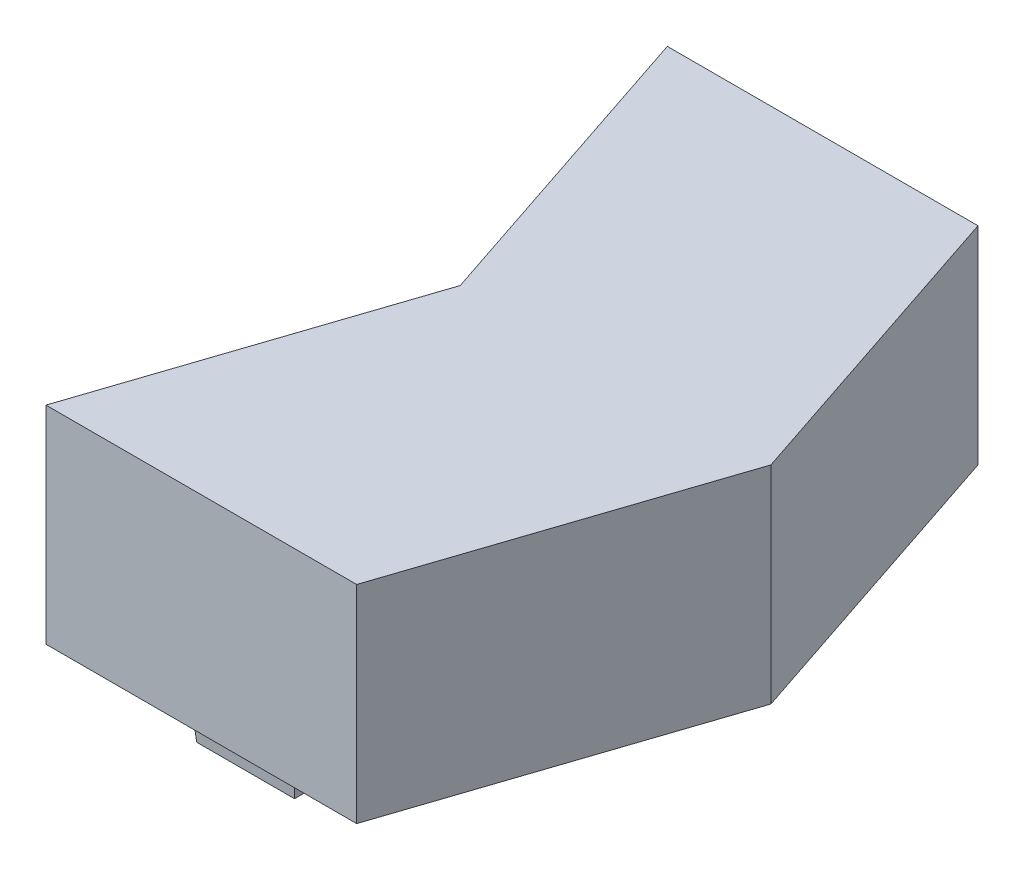
ISO-10303-21;
HEADER;
FILE_DESCRIPTION(('STEP AP214'),'2;1');
FILE_NAME('part.step','',(''),(''),'','','');
FILE_SCHEMA(('AUTOMOTIVE_DESIGN { 1 0 10303 214 1 1 1 1 }'));
ENDSEC;
DATA;
#1=APPLICATION_CONTEXT('core data for automotive mechanical design processes');
#2=APPLICATION_PROTOCOL_DEFINITION('international standard','automotive_design',2000,#1);
#3=PRODUCT_CONTEXT('',#1,'mechanical');
#4=PRODUCT('Part','Part','',(#3));
#5=PRODUCT_RELATED_PRODUCT_CATEGORY('part','',(#4));
#6=PRODUCT_DEFINITION_FORMATION('','',#4);
#7=PRODUCT_DEFINITION_CONTEXT('part definition',#1,'design');
#8=PRODUCT_DEFINITION('design','',#6,#7);
#9=PRODUCT_DEFINITION_SHAPE('','',#8);
#10=(LENGTH_UNIT() NAMED_UNIT(*) SI_UNIT(.MILLI.,.METRE.));
#11=(NAMED_UNIT(*) PLANE_ANGLE_UNIT() SI_UNIT($,.RADIAN.));
#12=(NAMED_UNIT(*) SI_UNIT($,.STERADIAN.) SOLID_ANGLE_UNIT());
#13=UNCERTAINTY_MEASURE_WITH_UNIT(LENGTH_MEASURE(1.E-05),#10,'distance_accuracy_value','');
#14=(GEOMETRIC_REPRESENTATION_CONTEXT(3) GLOBAL_UNCERTAINTY_ASSIGNED_CONTEXT((#13)) GLOBAL_UNIT_ASSIGNED_CONTEXT((#10,
#11,#12)) REPRESENTATION_CONTEXT('',''));
#15=CARTESIAN_POINT('',(0.,0.,0.));
#16=DIRECTION('',(0.,0.,1.));
#17=DIRECTION('',(1.,0.,0.));
#18=AXIS2_PLACEMENT_3D('',#15,#16,#17);
#19=CARTESIAN_POINT('',(0.,0.,0.));
#20=DIRECTION('',(0.,1.,0.));
#21=DIRECTION('',(0.,0.,1.));
#22=AXIS2_PLACEMENT_3D('',#19,#20,#21);
#23=PLANE('',#22);
#24=DIRECTION('',(1.,0.,0.));
#25=VECTOR('',#24,1.);
#26=CARTESIAN_POINT('',(13.97,0.,-1.27000000000001));
#27=LINE('',#26,#25);
#28=CARTESIAN_POINT('',(7.62,0.,-1.27));
#29=VERTEX_POINT('',#28);
#30=CARTESIAN_POINT('',(13.97,0.,-1.27000000000001));
#31=VERTEX_POINT('',#30);
#32=EDGE_CURVE('E173',#29,#31,#27,.T.);
#33=ORIENTED_EDGE('',*,*,#32,.T.);
#34=DIRECTION('',(0.,0.,-1.));
#35=VECTOR('',#34,1.);
#36=CARTESIAN_POINT('',(13.97,0.,-1.27000000000001));
#37=LINE('',#36,#35);
#38=CARTESIAN_POINT('',(13.97,0.,-3.81000000000001));
#39=VERTEX_POINT('',#38);
#40=EDGE_CURVE('E184',#31,#39,#37,.T.);
#41=ORIENTED_EDGE('',*,*,#40,.T.);
#42=DIRECTION('',(-1.,0.,0.));
#43=VECTOR('',#42,1.);
#44=CARTESIAN_POINT('',(13.97,0.,-3.81000000000001));
#45=LINE('',#44,#43);
#46=CARTESIAN_POINT('',(7.62,0.,-3.81000000000001));
#47=VERTEX_POINT('',#46);
#48=EDGE_CURVE('E196',#39,#47,#45,.T.);
#49=ORIENTED_EDGE('',*,*,#48,.T.);
#50=DIRECTION('',(0.,0.,1.));
#51=VECTOR('',#50,1.);
#52=CARTESIAN_POINT('',(7.62,0.,-1.27));
#53=LINE('',#52,#51);
#54=EDGE_CURVE('E59',#47,#29,#53,.T.);
#55=ORIENTED_EDGE('',*,*,#54,.T.);
#56=EDGE_LOOP('',(#33,#41,#49,#55));
#57=FACE_BOUND('',#56,.T.);
#58=DIRECTION('',(-0.316227766016838,0.,0.948683298050514));
#59=VECTOR('',#58,1.);
#60=CARTESIAN_POINT('',(6.35,0.,-19.05));
#61=LINE('',#60,#59);
#62=CARTESIAN_POINT('',(6.35,0.,-19.05));
#63=VERTEX_POINT('',#62);
#64=CARTESIAN_POINT('',(0.,0.,0.));
#65=VERTEX_POINT('',#64);
#66=EDGE_CURVE('E302',#63,#65,#61,.T.);
#67=ORIENTED_EDGE('',*,*,#66,.F.);
#68=DIRECTION('',(0.316227766016838,0.,0.948683298050514));
#69=VECTOR('',#68,1.);
#70=CARTESIAN_POINT('',(0.,0.,-38.1));
#71=LINE('',#70,#69);
#72=CARTESIAN_POINT('',(0.,0.,-38.1));
#73=VERTEX_POINT('',#72);
#74=EDGE_CURVE('E311',#73,#63,#71,.T.);
#75=ORIENTED_EDGE('',*,*,#74,.F.);
#76=DIRECTION('',(-1.,0.,0.));
#77=VECTOR('',#76,1.);
#78=CARTESIAN_POINT('',(19.05,0.,-38.1));
#79=LINE('',#78,#77);
#80=CARTESIAN_POINT('',(19.05,0.,-38.1));
#81=VERTEX_POINT('',#80);
#82=EDGE_CURVE('E339',#81,#73,#79,.T.);
#83=ORIENTED_EDGE('',*,*,#82,.F.);
#84=DIRECTION('',(-0.316227766016838,0.,-0.948683298050514));
#85=VECTOR('',#84,1.);
#86=CARTESIAN_POINT('',(25.4,0.,-19.05));
#87=LINE('',#86,#85);
#88=CARTESIAN_POINT('',(25.4,0.,-19.05));
#89=VERTEX_POINT('',#88);
#90=EDGE_CURVE('E336',#89,#81,#87,.T.);
#91=ORIENTED_EDGE('',*,*,#90,.F.);
#92=DIRECTION('',(0.316227766016838,0.,-0.948683298050514));
#93=VECTOR('',#92,1.);
#94=CARTESIAN_POINT('',(19.05,0.,0.));
#95=LINE('',#94,#93);
#96=CARTESIAN_POINT('',(19.05,0.,0.));
#97=VERTEX_POINT('',#96);
#98=EDGE_CURVE('E333',#97,#89,#95,.T.);
#99=ORIENTED_EDGE('',*,*,#98,.F.);
#100=DIRECTION('',(1.,0.,0.));
#101=VECTOR('',#100,1.);
#102=CARTESIAN_POINT('',(0.,0.,0.));
#103=LINE('',#102,#101);
#104=EDGE_CURVE('E330',#65,#97,#103,.T.);
#105=ORIENTED_EDGE('',*,*,#104,.F.);
#106=EDGE_LOOP('',(#67,#75,#83,#91,#99,#105));
#107=FACE_BOUND('',#106,.T.);
#108=CARTESIAN_POINT('',(15.24,0.,-19.05));
#109=DIRECTION('',(0.,-1.,0.));
#110=DIRECTION('',(0.,0.,-1.));
#111=AXIS2_PLACEMENT_3D('',#108,#109,#110);
#112=CIRCLE('',#111,5.635000033);
#113=CARTESIAN_POINT('',(16.51,0.,-24.5400205256365));
#114=VERTEX_POINT('',#113);
#115=CARTESIAN_POINT('',(13.97,0.,-24.5400205256365));
#116=VERTEX_POINT('',#115);
#117=EDGE_CURVE('E288',#114,#116,#112,.T.);
#118=ORIENTED_EDGE('',*,*,#117,.F.);
#119=DIRECTION('',(0.,0.,1.));
#120=VECTOR('',#119,1.);
#121=CARTESIAN_POINT('',(16.51,0.,-24.5400205256365));
#122=LINE('',#121,#120);
#123=CARTESIAN_POINT('',(16.51,0.,-28.3500205256365));
#124=VERTEX_POINT('',#123);
#125=EDGE_CURVE('E238',#124,#114,#122,.T.);
#126=ORIENTED_EDGE('',*,*,#125,.F.);
#127=DIRECTION('',(1.,0.,0.));
#128=VECTOR('',#127,1.);
#129=CARTESIAN_POINT('',(16.51,0.,-28.3500205256365));
#130=LINE('',#129,#128);
#131=CARTESIAN_POINT('',(13.97,0.,-28.3500205256365));
#132=VERTEX_POINT('',#131);
#133=EDGE_CURVE('E267',#132,#124,#130,.T.);
#134=ORIENTED_EDGE('',*,*,#133,.F.);
#135=DIRECTION('',(0.,0.,-1.));
#136=VECTOR('',#135,1.);
#137=CARTESIAN_POINT('',(13.97,0.,-24.5400205256365));
#138=LINE('',#137,#136);
#139=EDGE_CURVE('E278',#116,#132,#138,.T.);
#140=ORIENTED_EDGE('',*,*,#139,.F.);
#141=EDGE_LOOP('',(#118,#126,#134,#140));
#142=FACE_BOUND('',#141,.T.);
#143=DIRECTION('',(0.,0.,1.));
#144=VECTOR('',#143,1.);
#145=CARTESIAN_POINT('',(13.97,0.,-36.83));
#146=LINE('',#145,#144);
#147=CARTESIAN_POINT('',(13.97,0.,-36.83));
#148=VERTEX_POINT('',#147);
#149=CARTESIAN_POINT('',(13.97,0.,-34.29));
#150=VERTEX_POINT('',#149);
#151=EDGE_CURVE('E180',#148,#150,#146,.T.);
#152=ORIENTED_EDGE('',*,*,#151,.F.);
#153=DIRECTION('',(1.,0.,0.));
#154=VECTOR('',#153,1.);
#155=CARTESIAN_POINT('',(13.97,0.,-36.83));
#156=LINE('',#155,#154);
#157=CARTESIAN_POINT('',(7.62,0.,-36.83));
#158=VERTEX_POINT('',#157);
#159=EDGE_CURVE('E230',#158,#148,#156,.T.);
#160=ORIENTED_EDGE('',*,*,#159,.F.);
#161=DIRECTION('',(0.,0.,-1.));
#162=VECTOR('',#161,1.);
#163=CARTESIAN_POINT('',(7.62,0.,-36.83));
#164=LINE('',#163,#162);
#165=CARTESIAN_POINT('',(7.62,0.,-34.29));
#166=VERTEX_POINT('',#165);
#167=EDGE_CURVE('E226',#166,#158,#164,.T.);
#168=ORIENTED_EDGE('',*,*,#167,.F.);
#169=DIRECTION('',(-1.,0.,0.));
#170=VECTOR('',#169,1.);
#171=CARTESIAN_POINT('',(13.97,0.,-34.29));
#172=LINE('',#171,#170);
#173=EDGE_CURVE('E67',#150,#166,#172,.T.);
#174=ORIENTED_EDGE('',*,*,#173,.F.);
#175=EDGE_LOOP('',(#152,#160,#168,#174));
#176=FACE_BOUND('',#175,.T.);
#177=ADVANCED_FACE('F43',(#57,#107,#142,#176),#23,.F.);
#178=CARTESIAN_POINT('',(6.35,12.7,-19.05));
#179=DIRECTION('',(0.948683298050514,0.,0.316227766016838));
#180=DIRECTION('',(0.316227766016838,0.,-0.948683298050514));
#181=AXIS2_PLACEMENT_3D('',#178,#179,#180);
#182=PLANE('',#181);
#183=ORIENTED_EDGE('',*,*,#66,.T.);
#184=DIRECTION('',(0.,-1.,0.));
#185=VECTOR('',#184,1.);
#186=CARTESIAN_POINT('',(0.,12.7,0.));
#187=LINE('',#186,#185);
#188=CARTESIAN_POINT('',(0.,12.7,0.));
#189=VERTEX_POINT('',#188);
#190=EDGE_CURVE('E11',#189,#65,#187,.T.);
#191=ORIENTED_EDGE('',*,*,#190,.F.);
#192=DIRECTION('',(-0.316227766016838,0.,0.948683298050514));
#193=VECTOR('',#192,1.);
#194=CARTESIAN_POINT('',(6.35,12.7,-19.05));
#195=LINE('',#194,#193);
#196=CARTESIAN_POINT('',(6.35,12.7,-19.05));
#197=VERTEX_POINT('',#196);
#198=EDGE_CURVE('E306',#197,#189,#195,.T.);
#199=ORIENTED_EDGE('',*,*,#198,.F.);
#200=DIRECTION('',(0.,-1.,0.));
#201=VECTOR('',#200,1.);
#202=CARTESIAN_POINT('',(6.35,12.7,-19.05));
#203=LINE('',#202,#201);
#204=EDGE_CURVE('E326',#197,#63,#203,.T.);
#205=ORIENTED_EDGE('',*,*,#204,.T.);
#206=EDGE_LOOP('',(#183,#191,#199,#205));
#207=FACE_BOUND('',#206,.T.);
#208=ADVANCED_FACE('F45',(#207),#182,.F.);
#209=CARTESIAN_POINT('',(0.,12.7,0.));
#210=DIRECTION('',(0.,0.,-1.));
#211=DIRECTION('',(-1.,0.,0.));
#212=AXIS2_PLACEMENT_3D('',#209,#210,#211);
#213=PLANE('',#212);
#214=ORIENTED_EDGE('',*,*,#104,.T.);
#215=DIRECTION('',(0.,-1.,0.));
#216=VECTOR('',#215,1.);
#217=CARTESIAN_POINT('',(19.05,12.7,0.));
#218=LINE('',#217,#216);
#219=CARTESIAN_POINT('',(19.05,12.7,0.));
#220=VERTEX_POINT('',#219);
#221=EDGE_CURVE('E52',#220,#97,#218,.T.);
#222=ORIENTED_EDGE('',*,*,#221,.F.);
#223=DIRECTION('',(1.,0.,0.));
#224=VECTOR('',#223,1.);
#225=CARTESIAN_POINT('',(0.,12.7,0.));
#226=LINE('',#225,#224);
#227=EDGE_CURVE('E310',#189,#220,#226,.T.);
#228=ORIENTED_EDGE('',*,*,#227,.F.);
#229=ORIENTED_EDGE('',*,*,#190,.T.);
#230=EDGE_LOOP('',(#214,#222,#228,#229));
#231=FACE_BOUND('',#230,.T.);
#232=ADVANCED_FACE('F386',(#231),#213,.F.);
#233=CARTESIAN_POINT('',(19.05,12.7,0.));
#234=DIRECTION('',(-0.948683298050514,0.,-0.316227766016838));
#235=DIRECTION('',(-0.316227766016838,0.,0.948683298050514));
#236=AXIS2_PLACEMENT_3D('',#233,#234,#235);
#237=PLANE('',#236);
#238=ORIENTED_EDGE('',*,*,#98,.T.);
#239=DIRECTION('',(0.,-1.,0.));
#240=VECTOR('',#239,1.);
#241=CARTESIAN_POINT('',(25.4,12.7,-19.05));
#242=LINE('',#241,#240);
#243=CARTESIAN_POINT('',(25.4,12.7,-19.05));
#244=VERTEX_POINT('',#243);
#245=EDGE_CURVE('E355',#244,#89,#242,.T.);
#246=ORIENTED_EDGE('',*,*,#245,.F.);
#247=DIRECTION('',(0.316227766016838,0.,-0.948683298050514));
#248=VECTOR('',#247,1.);
#249=CARTESIAN_POINT('',(19.05,12.7,0.));
#250=LINE('',#249,#248);
#251=EDGE_CURVE('E314',#220,#244,#250,.T.);
#252=ORIENTED_EDGE('',*,*,#251,.F.);
#253=ORIENTED_EDGE('',*,*,#221,.T.);
#254=EDGE_LOOP('',(#238,#246,#252,#253));
#255=FACE_BOUND('',#254,.T.);
#256=ADVANCED_FACE('F364',(#255),#237,.F.);
#257=CARTESIAN_POINT('',(25.4,12.7,-19.05));
#258=DIRECTION('',(-0.948683298050514,0.,0.316227766016838));
#259=DIRECTION('',(0.316227766016838,0.,0.948683298050514));
#260=AXIS2_PLACEMENT_3D('',#257,#258,#259);
#261=PLANE('',#260);
#262=ORIENTED_EDGE('',*,*,#90,.T.);
#263=DIRECTION('',(0.,-1.,0.));
#264=VECTOR('',#263,1.);
#265=CARTESIAN_POINT('',(19.05,12.7,-38.1));
#266=LINE('',#265,#264);
#267=CARTESIAN_POINT('',(19.05,12.7,-38.1));
#268=VERTEX_POINT('',#267);
#269=EDGE_CURVE('E351',#268,#81,#266,.T.);
#270=ORIENTED_EDGE('',*,*,#269,.F.);
#271=DIRECTION('',(-0.316227766016838,0.,-0.948683298050514));
#272=VECTOR('',#271,1.);
#273=CARTESIAN_POINT('',(25.4,12.7,-19.05));
#274=LINE('',#273,#272);
#275=EDGE_CURVE('E317',#244,#268,#274,.T.);
#276=ORIENTED_EDGE('',*,*,#275,.F.);
#277=ORIENTED_EDGE('',*,*,#245,.T.);
#278=EDGE_LOOP('',(#262,#270,#276,#277));
#279=FACE_BOUND('',#278,.T.);
#280=ADVANCED_FACE('F374',(#279),#261,.F.);
#281=CARTESIAN_POINT('',(19.05,12.7,-38.1));
#282=DIRECTION('',(0.,0.,1.));
#283=DIRECTION('',(1.,0.,0.));
#284=AXIS2_PLACEMENT_3D('',#281,#282,#283);
#285=PLANE('',#284);
#286=ORIENTED_EDGE('',*,*,#82,.T.);
#287=DIRECTION('',(0.,-1.,0.));
#288=VECTOR('',#287,1.);
#289=CARTESIAN_POINT('',(0.,12.7,-38.1));
#290=LINE('',#289,#288);
#291=CARTESIAN_POINT('',(0.,12.7,-38.1));
#292=VERTEX_POINT('',#291);
#293=EDGE_CURVE('E347',#292,#73,#290,.T.);
#294=ORIENTED_EDGE('',*,*,#293,.F.);
#295=DIRECTION('',(-1.,0.,0.));
#296=VECTOR('',#295,1.);
#297=CARTESIAN_POINT('',(19.05,12.7,-38.1));
#298=LINE('',#297,#296);
#299=EDGE_CURVE('E320',#268,#292,#298,.T.);
#300=ORIENTED_EDGE('',*,*,#299,.F.);
#301=ORIENTED_EDGE('',*,*,#269,.T.);
#302=EDGE_LOOP('',(#286,#294,#300,#301));
#303=FACE_BOUND('',#302,.T.);
#304=ADVANCED_FACE('F378',(#303),#285,.F.);
#305=CARTESIAN_POINT('',(0.,12.7,-38.1));
#306=DIRECTION('',(0.948683298050514,0.,-0.316227766016838));
#307=DIRECTION('',(-0.316227766016838,0.,-0.948683298050514));
#308=AXIS2_PLACEMENT_3D('',#305,#306,#307);
#309=PLANE('',#308);
#310=ORIENTED_EDGE('',*,*,#74,.T.);
#311=ORIENTED_EDGE('',*,*,#204,.F.);
#312=DIRECTION('',(0.316227766016838,0.,0.948683298050514));
#313=VECTOR('',#312,1.);
#314=CARTESIAN_POINT('',(0.,12.7,-38.1));
#315=LINE('',#314,#313);
#316=EDGE_CURVE('E323',#292,#197,#315,.T.);
#317=ORIENTED_EDGE('',*,*,#316,.F.);
#318=ORIENTED_EDGE('',*,*,#293,.T.);
#319=EDGE_LOOP('',(#310,#311,#317,#318));
#320=FACE_BOUND('',#319,.T.);
#321=ADVANCED_FACE('F389',(#320),#309,.F.);
#322=CARTESIAN_POINT('',(0.,12.7,0.));
#323=DIRECTION('',(0.,1.,0.));
#324=DIRECTION('',(0.,0.,1.));
#325=AXIS2_PLACEMENT_3D('',#322,#323,#324);
#326=PLANE('',#325);
#327=ORIENTED_EDGE('',*,*,#198,.T.);
#328=ORIENTED_EDGE('',*,*,#227,.T.);
#329=ORIENTED_EDGE('',*,*,#251,.T.);
#330=ORIENTED_EDGE('',*,*,#275,.T.);
#331=ORIENTED_EDGE('',*,*,#299,.T.);
#332=ORIENTED_EDGE('',*,*,#316,.T.);
#333=EDGE_LOOP('',(#327,#328,#329,#330,#331,#332));
#334=FACE_BOUND('',#333,.T.);
#335=ADVANCED_FACE('F382',(#334),#326,.T.);
#336=CARTESIAN_POINT('',(15.24,9.557999934,-19.05));
#337=DIRECTION('',(0.,-1.,0.));
#338=DIRECTION('',(0.,0.,-1.));
#339=AXIS2_PLACEMENT_3D('',#336,#337,#338);
#340=CYLINDRICAL_SURFACE('',#339,5.635000033);
#341=ORIENTED_EDGE('',*,*,#117,.T.);
#342=DIRECTION('',(0.,-1.,0.));
#343=VECTOR('',#342,1.);
#344=CARTESIAN_POINT('',(13.97,9.557999934,-24.5400205256365));
#345=LINE('',#344,#343);
#346=CARTESIAN_POINT('',(13.97,9.557999934,-24.5400205256365));
#347=VERTEX_POINT('',#346);
#348=EDGE_CURVE('E292',#347,#116,#345,.T.);
#349=ORIENTED_EDGE('',*,*,#348,.F.);
#350=CARTESIAN_POINT('',(15.24,9.557999934,-19.05));
#351=DIRECTION('',(0.,-1.,0.));
#352=DIRECTION('',(0.,0.,-1.));
#353=AXIS2_PLACEMENT_3D('',#350,#351,#352);
#354=CIRCLE('',#353,5.635000033);
#355=CARTESIAN_POINT('',(16.51,9.557999934,-24.5400205256365));
#356=VERTEX_POINT('',#355);
#357=EDGE_CURVE('E298',#356,#347,#354,.T.);
#358=ORIENTED_EDGE('',*,*,#357,.F.);
#359=DIRECTION('',(0.,-1.,0.));
#360=VECTOR('',#359,1.);
#361=CARTESIAN_POINT('',(16.51,9.557999934,-24.5400205256365));
#362=LINE('',#361,#360);
#363=EDGE_CURVE('E275',#356,#114,#362,.T.);
#364=ORIENTED_EDGE('',*,*,#363,.T.);
#365=EDGE_LOOP('',(#341,#349,#358,#364));
#366=FACE_BOUND('',#365,.T.);
#367=ADVANCED_FACE('F396',(#366),#340,.F.);
#368=CARTESIAN_POINT('',(15.24,9.557999934,-19.05));
#369=DIRECTION('',(0.,-1.,0.));
#370=DIRECTION('',(0.,0.,-1.));
#371=AXIS2_PLACEMENT_3D('',#368,#369,#370);
#372=PLANE('',#371);
#373=ORIENTED_EDGE('',*,*,#357,.T.);
#374=DIRECTION('',(0.,0.,-1.));
#375=VECTOR('',#374,1.);
#376=CARTESIAN_POINT('',(13.97,9.557999934,-24.5400205256365));
#377=LINE('',#376,#375);
#378=CARTESIAN_POINT('',(13.97,9.557999934,-28.3500205256365));
#379=VERTEX_POINT('',#378);
#380=EDGE_CURVE('E266',#347,#379,#377,.T.);
#381=ORIENTED_EDGE('',*,*,#380,.T.);
#382=DIRECTION('',(1.,0.,0.));
#383=VECTOR('',#382,1.);
#384=CARTESIAN_POINT('',(16.51,9.557999934,-28.3500205256365));
#385=LINE('',#384,#383);
#386=CARTESIAN_POINT('',(16.51,9.557999934,-28.3500205256365));
#387=VERTEX_POINT('',#386);
#388=EDGE_CURVE('E271',#379,#387,#385,.T.);
#389=ORIENTED_EDGE('',*,*,#388,.T.);
#390=DIRECTION('',(0.,0.,1.));
#391=VECTOR('',#390,1.);
#392=CARTESIAN_POINT('',(16.51,9.557999934,-24.5400205256365));
#393=LINE('',#392,#391);
#394=EDGE_CURVE('E263',#387,#356,#393,.T.);
#395=ORIENTED_EDGE('',*,*,#394,.T.);
#396=EDGE_LOOP('',(#373,#381,#389,#395));
#397=FACE_BOUND('',#396,.T.);
#398=ADVANCED_FACE('F407',(#397),#372,.T.);
#399=CARTESIAN_POINT('',(16.51,9.557999934,-24.5400205256365));
#400=DIRECTION('',(1.,0.,0.));
#401=DIRECTION('',(0.,0.,-1.));
#402=AXIS2_PLACEMENT_3D('',#399,#400,#401);
#403=PLANE('',#402);
#404=ORIENTED_EDGE('',*,*,#125,.T.);
#405=ORIENTED_EDGE('',*,*,#363,.F.);
#406=ORIENTED_EDGE('',*,*,#394,.F.);
#407=DIRECTION('',(0.,-1.,0.));
#408=VECTOR('',#407,1.);
#409=CARTESIAN_POINT('',(16.51,9.557999934,-28.3500205256365));
#410=LINE('',#409,#408);
#411=EDGE_CURVE('E285',#387,#124,#410,.T.);
#412=ORIENTED_EDGE('',*,*,#411,.T.);
#413=EDGE_LOOP('',(#404,#405,#406,#412));
#414=FACE_BOUND('',#413,.T.);
#415=ADVANCED_FACE('F411',(#414),#403,.F.);
#416=CARTESIAN_POINT('',(16.51,9.557999934,-28.3500205256365));
#417=DIRECTION('',(0.,0.,-1.));
#418=DIRECTION('',(-1.,0.,0.));
#419=AXIS2_PLACEMENT_3D('',#416,#417,#418);
#420=PLANE('',#419);
#421=ORIENTED_EDGE('',*,*,#133,.T.);
#422=ORIENTED_EDGE('',*,*,#411,.F.);
#423=ORIENTED_EDGE('',*,*,#388,.F.);
#424=DIRECTION('',(0.,-1.,0.));
#425=VECTOR('',#424,1.);
#426=CARTESIAN_POINT('',(13.97,9.557999934,-28.3500205256365));
#427=LINE('',#426,#425);
#428=EDGE_CURVE('E289',#379,#132,#427,.T.);
#429=ORIENTED_EDGE('',*,*,#428,.T.);
#430=EDGE_LOOP('',(#421,#422,#423,#429));
#431=FACE_BOUND('',#430,.T.);
#432=ADVANCED_FACE('F415',(#431),#420,.F.);
#433=CARTESIAN_POINT('',(13.97,9.557999934,-24.5400205256365));
#434=DIRECTION('',(-1.,0.,0.));
#435=DIRECTION('',(0.,0.,1.));
#436=AXIS2_PLACEMENT_3D('',#433,#434,#435);
#437=PLANE('',#436);
#438=ORIENTED_EDGE('',*,*,#139,.T.);
#439=ORIENTED_EDGE('',*,*,#428,.F.);
#440=ORIENTED_EDGE('',*,*,#380,.F.);
#441=ORIENTED_EDGE('',*,*,#348,.T.);
#442=EDGE_LOOP('',(#438,#439,#440,#441));
#443=FACE_BOUND('',#442,.T.);
#444=ADVANCED_FACE('F417',(#443),#437,.F.);
#445=CARTESIAN_POINT('',(13.97,0.,-36.83));
#446=DIRECTION('',(0.996194698091746,-0.0871557427476582,0.));
#447=DIRECTION('',(0.0871557427476582,0.996194698091746,0.));
#448=AXIS2_PLACEMENT_3D('',#445,#446,#447);
#449=PLANE('',#448);
#450=ORIENTED_EDGE('',*,*,#151,.T.);
#451=DIRECTION('',(0.0868265938642476,0.992432509138967,0.0868265938642476));
#452=VECTOR('',#451,1.);
#453=CARTESIAN_POINT('',(13.97,0.,-34.29));
#454=LINE('',#453,#452);
#455=CARTESIAN_POINT('',(13.7922230357153,-2.032,-34.4677769642847));
#456=VERTEX_POINT('',#455);
#457=EDGE_CURVE('E235',#456,#150,#454,.T.);
#458=ORIENTED_EDGE('',*,*,#457,.F.);
#459=DIRECTION('',(0.,0.,-1.));
#460=VECTOR('',#459,1.);
#461=CARTESIAN_POINT('',(13.7922230357153,-2.032,-36.83));
#462=LINE('',#461,#460);
#463=CARTESIAN_POINT('',(13.7922230357153,-2.032,-36.6522230357153));
#464=VERTEX_POINT('',#463);
#465=EDGE_CURVE('E234',#464,#456,#462,.F.);
#466=ORIENTED_EDGE('',*,*,#465,.F.);
#467=DIRECTION('',(0.0868265938642476,0.992432509138967,-0.0868265938642476));
#468=VECTOR('',#467,1.);
#469=CARTESIAN_POINT('',(13.97,0.,-36.83));
#470=LINE('',#469,#468);
#471=EDGE_CURVE('E240',#464,#148,#470,.T.);
#472=ORIENTED_EDGE('',*,*,#471,.T.);
#473=EDGE_LOOP('',(#450,#458,#466,#472));
#474=FACE_BOUND('',#473,.T.);
#475=ADVANCED_FACE('F420',(#474),#449,.T.);
#476=CARTESIAN_POINT('',(13.97,0.,-34.29));
#477=DIRECTION('',(0.,-0.0871557427476582,0.996194698091746));
#478=DIRECTION('',(0.,-0.996194698091746,-0.0871557427476582));
#479=AXIS2_PLACEMENT_3D('',#476,#477,#478);
#480=PLANE('',#479);
#481=ORIENTED_EDGE('',*,*,#173,.T.);
#482=DIRECTION('',(-0.0868265938642476,0.992432509138967,0.0868265938642476));
#483=VECTOR('',#482,1.);
#484=CARTESIAN_POINT('',(7.63914869780125,-0.218870617398061,-34.3091486978013));
#485=LINE('',#484,#483);
#486=CARTESIAN_POINT('',(7.79777696428468,-2.032,-34.4677769642847));
#487=VERTEX_POINT('',#486);
#488=EDGE_CURVE('E239',#487,#166,#485,.T.);
#489=ORIENTED_EDGE('',*,*,#488,.F.);
#490=DIRECTION('',(1.,0.,0.));
#491=VECTOR('',#490,1.);
#492=CARTESIAN_POINT('',(13.97,-2.032,-34.4677769642847));
#493=LINE('',#492,#491);
#494=EDGE_CURVE('E255',#456,#487,#493,.F.);
#495=ORIENTED_EDGE('',*,*,#494,.F.);
#496=ORIENTED_EDGE('',*,*,#457,.T.);
#497=EDGE_LOOP('',(#481,#489,#495,#496));
#498=FACE_BOUND('',#497,.T.);
#499=ADVANCED_FACE('F425',(#498),#480,.T.);
#500=CARTESIAN_POINT('',(7.62,0.,-36.83));
#501=DIRECTION('',(-0.996194698091746,-0.0871557427476582,0.));
#502=DIRECTION('',(0.0871557427476582,-0.996194698091746,0.));
#503=AXIS2_PLACEMENT_3D('',#500,#501,#502);
#504=PLANE('',#503);
#505=ORIENTED_EDGE('',*,*,#167,.T.);
#506=DIRECTION('',(-0.0868265938642477,0.992432509138967,-0.0868265938642476));
#507=VECTOR('',#506,1.);
#508=CARTESIAN_POINT('',(7.66787174450312,-0.547176543495152,-36.7821282554969));
#509=LINE('',#508,#507);
#510=CARTESIAN_POINT('',(7.79777696428468,-2.032,-36.6522230357153));
#511=VERTEX_POINT('',#510);
#512=EDGE_CURVE('E244',#511,#158,#509,.T.);
#513=ORIENTED_EDGE('',*,*,#512,.F.);
#514=DIRECTION('',(0.,0.,1.));
#515=VECTOR('',#514,1.);
#516=CARTESIAN_POINT('',(7.79777696428468,-2.032,-36.83));
#517=LINE('',#516,#515);
#518=EDGE_CURVE('E258',#487,#511,#517,.F.);
#519=ORIENTED_EDGE('',*,*,#518,.F.);
#520=ORIENTED_EDGE('',*,*,#488,.T.);
#521=EDGE_LOOP('',(#505,#513,#519,#520));
#522=FACE_BOUND('',#521,.T.);
#523=ADVANCED_FACE('F428',(#522),#504,.T.);
#524=CARTESIAN_POINT('',(13.97,0.,-36.83));
#525=DIRECTION('',(0.,-0.0871557427476582,-0.996194698091745));
#526=DIRECTION('',(0.,0.996194698091746,-0.0871557427476582));
#527=AXIS2_PLACEMENT_3D('',#524,#525,#526);
#528=PLANE('',#527);
#529=ORIENTED_EDGE('',*,*,#159,.T.);
#530=ORIENTED_EDGE('',*,*,#471,.F.);
#531=DIRECTION('',(-1.,0.,0.));
#532=VECTOR('',#531,1.);
#533=CARTESIAN_POINT('',(13.97,-2.032,-36.6522230357153));
#534=LINE('',#533,#532);
#535=EDGE_CURVE('E245',#511,#464,#534,.F.);
#536=ORIENTED_EDGE('',*,*,#535,.F.);
#537=ORIENTED_EDGE('',*,*,#512,.T.);
#538=EDGE_LOOP('',(#529,#530,#536,#537));
#539=FACE_BOUND('',#538,.T.);
#540=ADVANCED_FACE('F432',(#539),#528,.T.);
#541=CARTESIAN_POINT('',(0.,-2.032,0.));
#542=DIRECTION('',(0.,-1.,0.));
#543=DIRECTION('',(0.,0.,-1.));
#544=AXIS2_PLACEMENT_3D('',#541,#542,#543);
#545=PLANE('',#544);
#546=ORIENTED_EDGE('',*,*,#465,.T.);
#547=ORIENTED_EDGE('',*,*,#494,.T.);
#548=ORIENTED_EDGE('',*,*,#518,.T.);
#549=ORIENTED_EDGE('',*,*,#535,.T.);
#550=EDGE_LOOP('',(#546,#547,#548,#549));
#551=FACE_BOUND('',#550,.T.);
#552=ADVANCED_FACE('F436',(#551),#545,.T.);
#553=CARTESIAN_POINT('',(13.97,0.,-1.27000000000001));
#554=DIRECTION('',(0.996194698091746,-0.0871557427476582,0.));
#555=DIRECTION('',(0.0871557427476582,0.996194698091746,0.));
#556=AXIS2_PLACEMENT_3D('',#553,#554,#555);
#557=PLANE('',#556);
#558=ORIENTED_EDGE('',*,*,#40,.F.);
#559=DIRECTION('',(0.0868265938642477,0.992432509138967,0.0868265938642476));
#560=VECTOR('',#559,1.);
#561=CARTESIAN_POINT('',(13.97,0.,-1.27000000000001));
#562=LINE('',#561,#560);
#563=CARTESIAN_POINT('',(13.7922230357153,-2.032,-1.44777696428468));
#564=VERTEX_POINT('',#563);
#565=EDGE_CURVE('E169',#564,#31,#562,.T.);
#566=ORIENTED_EDGE('',*,*,#565,.F.);
#567=DIRECTION('',(0.,0.,-1.));
#568=VECTOR('',#567,1.);
#569=CARTESIAN_POINT('',(13.7922230357153,-2.032,-1.27000000000001));
#570=LINE('',#569,#568);
#571=CARTESIAN_POINT('',(13.7922230357153,-2.032,-3.63222303571533));
#572=VERTEX_POINT('',#571);
#573=EDGE_CURVE('E200',#564,#572,#570,.T.);
#574=ORIENTED_EDGE('',*,*,#573,.T.);
#575=DIRECTION('',(0.0868265938642476,0.992432509138967,-0.0868265938642477));
#576=VECTOR('',#575,1.);
#577=CARTESIAN_POINT('',(13.9508513021988,-0.218870617398061,-3.79085130219876));
#578=LINE('',#577,#576);
#579=EDGE_CURVE('E186',#572,#39,#578,.T.);
#580=ORIENTED_EDGE('',*,*,#579,.T.);
#581=EDGE_LOOP('',(#558,#566,#574,#580));
#582=FACE_BOUND('',#581,.T.);
#583=ADVANCED_FACE('F185',(#582),#557,.T.);
#584=CARTESIAN_POINT('',(13.97,0.,-1.27000000000001));
#585=DIRECTION('',(0.,-0.0871557427476582,0.996194698091745));
#586=DIRECTION('',(0.,-0.996194698091746,-0.0871557427476582));
#587=AXIS2_PLACEMENT_3D('',#584,#585,#586);
#588=PLANE('',#587);
#589=ORIENTED_EDGE('',*,*,#32,.F.);
#590=DIRECTION('',(-0.0868265938642476,0.992432509138967,0.0868265938642477));
#591=VECTOR('',#590,1.);
#592=CARTESIAN_POINT('',(7.62,0.,-1.27000000000001));
#593=LINE('',#592,#591);
#594=CARTESIAN_POINT('',(7.79777696428468,-2.032,-1.44777696428468));
#595=VERTEX_POINT('',#594);
#596=EDGE_CURVE('E181',#595,#29,#593,.T.);
#597=ORIENTED_EDGE('',*,*,#596,.F.);
#598=DIRECTION('',(1.,0.,0.));
#599=VECTOR('',#598,1.);
#600=CARTESIAN_POINT('',(13.97,-2.032,-1.44777696428468));
#601=LINE('',#600,#599);
#602=EDGE_CURVE('E175',#595,#564,#601,.T.);
#603=ORIENTED_EDGE('',*,*,#602,.T.);
#604=ORIENTED_EDGE('',*,*,#565,.T.);
#605=EDGE_LOOP('',(#589,#597,#603,#604));
#606=FACE_BOUND('',#605,.T.);
#607=ADVANCED_FACE('F171',(#606),#588,.T.);
#608=CARTESIAN_POINT('',(7.62,0.,-1.27));
#609=DIRECTION('',(-0.996194698091746,-0.0871557427476582,0.));
#610=DIRECTION('',(0.0871557427476582,-0.996194698091746,0.));
#611=AXIS2_PLACEMENT_3D('',#608,#609,#610);
#612=PLANE('',#611);
#613=ORIENTED_EDGE('',*,*,#54,.F.);
#614=DIRECTION('',(-0.0868265938642476,0.992432509138967,-0.0868265938642476));
#615=VECTOR('',#614,1.);
#616=CARTESIAN_POINT('',(7.66787174450313,-0.547176543495152,-3.76212825549688));
#617=LINE('',#616,#615);
#618=CARTESIAN_POINT('',(7.79777696428468,-2.032,-3.63222303571533));
#619=VERTEX_POINT('',#618);
#620=EDGE_CURVE('E204',#619,#47,#617,.T.);
#621=ORIENTED_EDGE('',*,*,#620,.F.);
#622=DIRECTION('',(0.,0.,1.));
#623=VECTOR('',#622,1.);
#624=CARTESIAN_POINT('',(7.79777696428468,-2.032,-1.27));
#625=LINE('',#624,#623);
#626=EDGE_CURVE('E214',#619,#595,#625,.T.);
#627=ORIENTED_EDGE('',*,*,#626,.T.);
#628=ORIENTED_EDGE('',*,*,#596,.T.);
#629=EDGE_LOOP('',(#613,#621,#627,#628));
#630=FACE_BOUND('',#629,.T.);
#631=ADVANCED_FACE('F446',(#630),#612,.T.);
#632=CARTESIAN_POINT('',(13.97,0.,-3.81000000000001));
#633=DIRECTION('',(0.,-0.0871557427476582,-0.996194698091746));
#634=DIRECTION('',(0.,0.996194698091746,-0.0871557427476582));
#635=AXIS2_PLACEMENT_3D('',#632,#633,#634);
#636=PLANE('',#635);
#637=ORIENTED_EDGE('',*,*,#48,.F.);
#638=ORIENTED_EDGE('',*,*,#579,.F.);
#639=DIRECTION('',(-1.,0.,0.));
#640=VECTOR('',#639,1.);
#641=CARTESIAN_POINT('',(13.97,-2.032,-3.63222303571533));
#642=LINE('',#641,#640);
#643=EDGE_CURVE('E205',#572,#619,#642,.T.);
#644=ORIENTED_EDGE('',*,*,#643,.T.);
#645=ORIENTED_EDGE('',*,*,#620,.T.);
#646=EDGE_LOOP('',(#637,#638,#644,#645));
#647=FACE_BOUND('',#646,.T.);
#648=ADVANCED_FACE('F449',(#647),#636,.T.);
#649=CARTESIAN_POINT('',(0.,-2.032,-38.1));
#650=DIRECTION('',(0.,-1.,0.));
#651=DIRECTION('',(0.,0.,1.));
#652=AXIS2_PLACEMENT_3D('',#649,#650,#651);
#653=PLANE('',#652);
#654=ORIENTED_EDGE('',*,*,#573,.F.);
#655=ORIENTED_EDGE('',*,*,#602,.F.);
#656=ORIENTED_EDGE('',*,*,#626,.F.);
#657=ORIENTED_EDGE('',*,*,#643,.F.);
#658=EDGE_LOOP('',(#654,#655,#656,#657));
#659=FACE_BOUND('',#658,.T.);
#660=ADVANCED_FACE('F452',(#659),#653,.T.);
#661=CLOSED_SHELL('',(#177,#208,#232,#256,#280,#304,#321,#335,#367,#398,#415,#432,#444,#475,
#499,#523,#540,#552,#583,#607,#631,#648,#660));
#662=MANIFOLD_SOLID_BREP('B2',#661);
#663=ADVANCED_BREP_SHAPE_REPRESENTATION('',(#18,#662),#14);
#664=SHAPE_DEFINITION_REPRESENTATION(#9,#663);
ENDSEC;
END-ISO-10303-21;
